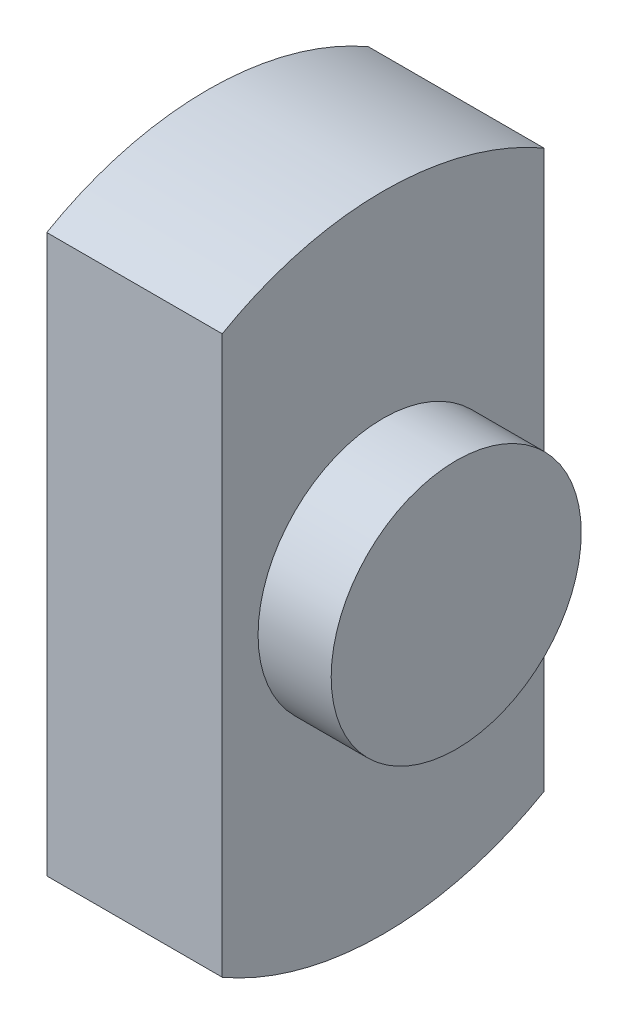
ISO-10303-21;
HEADER;
FILE_DESCRIPTION(('STEP AP214'),'2;1');
FILE_NAME('part.step','',(''),(''),'','','');
FILE_SCHEMA(('AUTOMOTIVE_DESIGN { 1 0 10303 214 1 1 1 1 }'));
ENDSEC;
DATA;
#1=APPLICATION_CONTEXT('core data for automotive mechanical design processes');
#2=APPLICATION_PROTOCOL_DEFINITION('international standard','automotive_design',2000,#1);
#3=PRODUCT_CONTEXT('',#1,'mechanical');
#4=PRODUCT('Part','Part','',(#3));
#5=PRODUCT_RELATED_PRODUCT_CATEGORY('part','',(#4));
#6=PRODUCT_DEFINITION_FORMATION('','',#4);
#7=PRODUCT_DEFINITION_CONTEXT('part definition',#1,'design');
#8=PRODUCT_DEFINITION('design','',#6,#7);
#9=PRODUCT_DEFINITION_SHAPE('','',#8);
#10=(LENGTH_UNIT() NAMED_UNIT(*) SI_UNIT(.MILLI.,.METRE.));
#11=(NAMED_UNIT(*) PLANE_ANGLE_UNIT() SI_UNIT($,.RADIAN.));
#12=(NAMED_UNIT(*) SI_UNIT($,.STERADIAN.) SOLID_ANGLE_UNIT());
#13=UNCERTAINTY_MEASURE_WITH_UNIT(LENGTH_MEASURE(1.E-05),#10,'distance_accuracy_value','');
#14=(GEOMETRIC_REPRESENTATION_CONTEXT(3) GLOBAL_UNCERTAINTY_ASSIGNED_CONTEXT((#13)) GLOBAL_UNIT_ASSIGNED_CONTEXT((#10,
#11,#12)) REPRESENTATION_CONTEXT('',''));
#15=CARTESIAN_POINT('',(0.,0.,0.));
#16=DIRECTION('',(0.,0.,1.));
#17=DIRECTION('',(1.,0.,0.));
#18=AXIS2_PLACEMENT_3D('',#15,#16,#17);
#19=CARTESIAN_POINT('',(12.,0.,0.));
#20=DIRECTION('',(-1.,0.,0.));
#21=DIRECTION('',(0.,0.,1.));
#22=AXIS2_PLACEMENT_3D('',#19,#20,#21);
#23=CYLINDRICAL_SURFACE('',#22,22.);
#24=CARTESIAN_POINT('',(12.,0.,0.));
#25=DIRECTION('',(1.,0.,0.));
#26=DIRECTION('',(0.,0.,-1.));
#27=AXIS2_PLACEMENT_3D('',#24,#25,#26);
#28=CIRCLE('',#27,22.);
#29=CARTESIAN_POINT('',(12.,-19.0525588832576,11.));
#30=VERTEX_POINT('',#29);
#31=CARTESIAN_POINT('',(12.,-19.0525588832576,-11.));
#32=VERTEX_POINT('',#31);
#33=EDGE_CURVE('E257',#30,#32,#28,.T.);
#34=ORIENTED_EDGE('',*,*,#33,.F.);
#35=DIRECTION('',(-1.,0.,0.));
#36=VECTOR('',#35,1.);
#37=CARTESIAN_POINT('',(12.,-19.0525588832576,11.));
#38=LINE('',#37,#36);
#39=CARTESIAN_POINT('',(0.,-19.0525588832576,11.));
#40=VERTEX_POINT('',#39);
#41=EDGE_CURVE('E635',#30,#40,#38,.T.);
#42=ORIENTED_EDGE('',*,*,#41,.T.);
#43=CARTESIAN_POINT('',(0.,0.,0.));
#44=DIRECTION('',(1.,0.,0.));
#45=DIRECTION('',(0.,0.,-1.));
#46=AXIS2_PLACEMENT_3D('',#43,#44,#45);
#47=CIRCLE('',#46,22.);
#48=CARTESIAN_POINT('',(0.,-21.837327130716,2.67042015160434));
#49=VERTEX_POINT('',#48);
#50=EDGE_CURVE('E253',#40,#49,#47,.T.);
#51=ORIENTED_EDGE('',*,*,#50,.T.);
#52=DIRECTION('',(-1.,0.,0.));
#53=VECTOR('',#52,1.);
#54=CARTESIAN_POINT('',(5.5,-21.837327130716,2.67042015160434));
#55=LINE('',#54,#53);
#56=CARTESIAN_POINT('',(5.5,-21.837327130716,2.67042015160434));
#57=VERTEX_POINT('',#56);
#58=EDGE_CURVE('E470',#57,#49,#55,.T.);
#59=ORIENTED_EDGE('',*,*,#58,.F.);
#60=CARTESIAN_POINT('',(5.5,0.,0.));
#61=DIRECTION('',(1.,0.,0.));
#62=DIRECTION('',(0.,0.,-1.));
#63=AXIS2_PLACEMENT_3D('',#60,#61,#62);
#64=CIRCLE('',#63,22.);
#65=CARTESIAN_POINT('',(5.5,-21.837327130716,-2.67042015160433));
#66=VERTEX_POINT('',#65);
#67=EDGE_CURVE('E262',#57,#66,#64,.T.);
#68=ORIENTED_EDGE('',*,*,#67,.T.);
#69=DIRECTION('',(-1.,0.,0.));
#70=VECTOR('',#69,1.);
#71=CARTESIAN_POINT('',(5.5,-21.837327130716,-2.67042015160433));
#72=LINE('',#71,#70);
#73=CARTESIAN_POINT('',(0.,-21.837327130716,-2.67042015160433));
#74=VERTEX_POINT('',#73);
#75=EDGE_CURVE('E474',#66,#74,#72,.T.);
#76=ORIENTED_EDGE('',*,*,#75,.T.);
#77=CARTESIAN_POINT('',(0.,-19.0525588832576,-11.));
#78=VERTEX_POINT('',#77);
#79=EDGE_CURVE('E252',#74,#78,#47,.T.);
#80=ORIENTED_EDGE('',*,*,#79,.T.);
#81=DIRECTION('',(-1.,0.,0.));
#82=VECTOR('',#81,1.);
#83=CARTESIAN_POINT('',(12.,-19.0525588832576,-11.));
#84=LINE('',#83,#82);
#85=EDGE_CURVE('E62',#78,#32,#84,.F.);
#86=ORIENTED_EDGE('',*,*,#85,.T.);
#87=EDGE_LOOP('',(#34,#42,#51,#59,#68,#76,#80,#86));
#88=FACE_BOUND('',#87,.T.);
#89=ADVANCED_FACE('F39',(#88),#23,.T.);
#90=CARTESIAN_POINT('',(5.5,19.5568517413347,6.50000000000001));
#91=DIRECTION('',(0.,0.,-1.));
#92=DIRECTION('',(0.,1.,0.));
#93=AXIS2_PLACEMENT_3D('',#90,#91,#92);
#94=PLANE('',#93);
#95=DIRECTION('',(-1.,0.,0.));
#96=VECTOR('',#95,1.);
#97=CARTESIAN_POINT('',(5.5,-6.94314825866529,6.5));
#98=LINE('',#97,#96);
#99=CARTESIAN_POINT('',(5.5,-6.94314825866529,6.5));
#100=VERTEX_POINT('',#99);
#101=CARTESIAN_POINT('',(4.25,-6.94314825866529,6.5));
#102=VERTEX_POINT('',#101);
#103=EDGE_CURVE('E457',#100,#102,#98,.T.);
#104=ORIENTED_EDGE('',*,*,#103,.T.);
#105=DIRECTION('',(0.,-1.,0.));
#106=VECTOR('',#105,1.);
#107=CARTESIAN_POINT('',(4.25,-5.94314825866529,6.5));
#108=LINE('',#107,#106);
#109=CARTESIAN_POINT('',(4.25,-5.94314825866529,6.5));
#110=VERTEX_POINT('',#109);
#111=EDGE_CURVE('E651',#110,#102,#108,.T.);
#112=ORIENTED_EDGE('',*,*,#111,.F.);
#113=DIRECTION('',(1.,0.,0.));
#114=VECTOR('',#113,1.);
#115=CARTESIAN_POINT('',(0.,-5.94314825866529,6.5));
#116=LINE('',#115,#114);
#117=CARTESIAN_POINT('',(3.,-5.94314825866529,6.5));
#118=VERTEX_POINT('',#117);
#119=EDGE_CURVE('E511',#118,#110,#116,.T.);
#120=ORIENTED_EDGE('',*,*,#119,.F.);
#121=DIRECTION('',(0.,1.,0.));
#122=VECTOR('',#121,1.);
#123=CARTESIAN_POINT('',(3.,19.5568517413347,6.50000000000001));
#124=LINE('',#123,#122);
#125=CARTESIAN_POINT('',(3.,17.1748906632346,6.50000000000001));
#126=VERTEX_POINT('',#125);
#127=EDGE_CURVE('E355',#118,#126,#124,.T.);
#128=ORIENTED_EDGE('',*,*,#127,.T.);
#129=DIRECTION('',(1.,0.,0.));
#130=VECTOR('',#129,1.);
#131=CARTESIAN_POINT('',(5.5,17.1748906632346,6.50000000000001));
#132=LINE('',#131,#130);
#133=CARTESIAN_POINT('',(0.,17.1748906632346,6.5));
#134=VERTEX_POINT('',#133);
#135=EDGE_CURVE('E370',#134,#126,#132,.T.);
#136=ORIENTED_EDGE('',*,*,#135,.F.);
#137=DIRECTION('',(0.,-1.,0.));
#138=VECTOR('',#137,1.);
#139=CARTESIAN_POINT('',(0.,19.5568517413347,6.50000000000001));
#140=LINE('',#139,#138);
#141=CARTESIAN_POINT('',(0.,19.5568517413347,6.50000000000001));
#142=VERTEX_POINT('',#141);
#143=EDGE_CURVE('E380',#142,#134,#140,.T.);
#144=ORIENTED_EDGE('',*,*,#143,.F.);
#145=DIRECTION('',(-1.,0.,0.));
#146=VECTOR('',#145,1.);
#147=CARTESIAN_POINT('',(5.5,19.5568517413347,6.50000000000001));
#148=LINE('',#147,#146);
#149=CARTESIAN_POINT('',(5.5,19.5568517413347,6.50000000000001));
#150=VERTEX_POINT('',#149);
#151=EDGE_CURVE('E258',#150,#142,#148,.T.);
#152=ORIENTED_EDGE('',*,*,#151,.F.);
#153=DIRECTION('',(0.,-1.,0.));
#154=VECTOR('',#153,1.);
#155=CARTESIAN_POINT('',(5.5,19.5568517413347,6.50000000000001));
#156=LINE('',#155,#154);
#157=EDGE_CURVE('E413',#150,#100,#156,.T.);
#158=ORIENTED_EDGE('',*,*,#157,.T.);
#159=EDGE_LOOP('',(#104,#112,#120,#128,#136,#144,#152,#158));
#160=FACE_BOUND('',#159,.T.);
#161=ADVANCED_FACE('F508',(#160),#94,.T.);
#162=CARTESIAN_POINT('',(5.5,-6.94314825866529,6.5));
#163=DIRECTION('',(0.,1.,0.));
#164=DIRECTION('',(0.,0.,1.));
#165=AXIS2_PLACEMENT_3D('',#162,#163,#164);
#166=PLANE('',#165);
#167=DIRECTION('',(0.,0.,1.));
#168=VECTOR('',#167,1.);
#169=CARTESIAN_POINT('',(3.,-6.9431482586653,9.00000000000001));
#170=LINE('',#169,#168);
#171=CARTESIAN_POINT('',(3.,-6.9431482586653,6.5));
#172=VERTEX_POINT('',#171);
#173=CARTESIAN_POINT('',(3.,-6.9431482586653,9.00000000000001));
#174=VERTEX_POINT('',#173);
#175=EDGE_CURVE('E325',#172,#174,#170,.T.);
#176=ORIENTED_EDGE('',*,*,#175,.F.);
#177=DIRECTION('',(1.,0.,0.));
#178=VECTOR('',#177,1.);
#179=CARTESIAN_POINT('',(0.,-6.94314825866529,6.5));
#180=LINE('',#179,#178);
#181=CARTESIAN_POINT('',(0.,-6.94314825866529,6.5));
#182=VERTEX_POINT('',#181);
#183=EDGE_CURVE('E654',#182,#172,#180,.T.);
#184=ORIENTED_EDGE('',*,*,#183,.F.);
#185=DIRECTION('',(0.,0.,-1.));
#186=VECTOR('',#185,1.);
#187=CARTESIAN_POINT('',(0.,-6.94314825866529,6.5));
#188=LINE('',#187,#186);
#189=CARTESIAN_POINT('',(0.,-6.9431482586653,9.00000000000001));
#190=VERTEX_POINT('',#189);
#191=EDGE_CURVE('E448',#190,#182,#188,.T.);
#192=ORIENTED_EDGE('',*,*,#191,.F.);
#193=DIRECTION('',(-1.,0.,0.));
#194=VECTOR('',#193,1.);
#195=CARTESIAN_POINT('',(3.,-6.9431482586653,9.00000000000001));
#196=LINE('',#195,#194);
#197=EDGE_CURVE('E359',#174,#190,#196,.T.);
#198=ORIENTED_EDGE('',*,*,#197,.F.);
#199=EDGE_LOOP('',(#176,#184,#192,#198));
#200=FACE_BOUND('',#199,.T.);
#201=ADVANCED_FACE('F546',(#200),#166,.T.);
#202=DIRECTION('',(-1.,0.,0.));
#203=VECTOR('',#202,1.);
#204=CARTESIAN_POINT('',(5.5,-6.94314825866529,4.76239289224447));
#205=LINE('',#204,#203);
#206=CARTESIAN_POINT('',(5.5,-6.94314825866529,4.76239289224447));
#207=VERTEX_POINT('',#206);
#208=CARTESIAN_POINT('',(4.25,-6.94314825866529,4.76239289224447));
#209=VERTEX_POINT('',#208);
#210=EDGE_CURVE('E461',#207,#209,#205,.T.);
#211=ORIENTED_EDGE('',*,*,#210,.T.);
#212=DIRECTION('',(0.,0.,-1.));
#213=VECTOR('',#212,1.);
#214=CARTESIAN_POINT('',(4.25,-6.94314825866529,4.76239289224447));
#215=LINE('',#214,#213);
#216=EDGE_CURVE('E646',#102,#209,#215,.T.);
#217=ORIENTED_EDGE('',*,*,#216,.F.);
#218=ORIENTED_EDGE('',*,*,#103,.F.);
#219=DIRECTION('',(0.,0.,-1.));
#220=VECTOR('',#219,1.);
#221=CARTESIAN_POINT('',(5.5,-6.94314825866529,6.5));
#222=LINE('',#221,#220);
#223=EDGE_CURVE('E410',#100,#207,#222,.T.);
#224=ORIENTED_EDGE('',*,*,#223,.T.);
#225=EDGE_LOOP('',(#211,#217,#218,#224));
#226=FACE_BOUND('',#225,.T.);
#227=ADVANCED_FACE('F585',(#226),#166,.T.);
#228=CARTESIAN_POINT('',(5.5,-6.94314825866529,-6.5));
#229=DIRECTION('',(0.,-1.,0.));
#230=DIRECTION('',(0.,0.,-1.));
#231=AXIS2_PLACEMENT_3D('',#228,#229,#230);
#232=PLANE('',#231);
#233=DIRECTION('',(0.,0.,-1.));
#234=VECTOR('',#233,1.);
#235=CARTESIAN_POINT('',(4.,-6.94314825866529,-6.51239289224447));
#236=LINE('',#235,#234);
#237=CARTESIAN_POINT('',(4.,-6.94314825866529,-4.76239289224447));
#238=VERTEX_POINT('',#237);
#239=CARTESIAN_POINT('',(4.,-6.94314825866529,-6.5));
#240=VERTEX_POINT('',#239);
#241=EDGE_CURVE('E289',#238,#240,#236,.T.);
#242=ORIENTED_EDGE('',*,*,#241,.F.);
#243=DIRECTION('',(-1.,0.,0.));
#244=VECTOR('',#243,1.);
#245=CARTESIAN_POINT('',(5.5,-6.94314825866529,-4.76239289224447));
#246=LINE('',#245,#244);
#247=CARTESIAN_POINT('',(5.5,-6.94314825866529,-4.76239289224447));
#248=VERTEX_POINT('',#247);
#249=EDGE_CURVE('E484',#248,#238,#246,.T.);
#250=ORIENTED_EDGE('',*,*,#249,.F.);
#251=DIRECTION('',(0.,0.,1.));
#252=VECTOR('',#251,1.);
#253=CARTESIAN_POINT('',(5.5,-6.94314825866529,-6.5));
#254=LINE('',#253,#252);
#255=CARTESIAN_POINT('',(5.5,-6.94314825866529,-6.5));
#256=VERTEX_POINT('',#255);
#257=EDGE_CURVE('E384',#256,#248,#254,.T.);
#258=ORIENTED_EDGE('',*,*,#257,.F.);
#259=DIRECTION('',(-1.,0.,0.));
#260=VECTOR('',#259,1.);
#261=CARTESIAN_POINT('',(5.5,-6.94314825866529,-6.5));
#262=LINE('',#261,#260);
#263=EDGE_CURVE('E488',#256,#240,#262,.T.);
#264=ORIENTED_EDGE('',*,*,#263,.T.);
#265=EDGE_LOOP('',(#242,#250,#258,#264));
#266=FACE_BOUND('',#265,.T.);
#267=ADVANCED_FACE('F607',(#266),#232,.F.);
#268=DIRECTION('',(-1.,0.,0.));
#269=VECTOR('',#268,1.);
#270=CARTESIAN_POINT('',(0.,-6.94314825866529,-6.51239289224447));
#271=LINE('',#270,#269);
#272=CARTESIAN_POINT('',(3.,-6.94314825866529,-6.51239289224447));
#273=VERTEX_POINT('',#272);
#274=CARTESIAN_POINT('',(0.,-6.94314825866529,-6.51239289224447));
#275=VERTEX_POINT('',#274);
#276=EDGE_CURVE('E619',#273,#275,#271,.T.);
#277=ORIENTED_EDGE('',*,*,#276,.F.);
#278=CARTESIAN_POINT('',(3.,-6.9431482586653,-9.));
#279=VERTEX_POINT('',#278);
#280=EDGE_CURVE('E327',#279,#273,#170,.T.);
#281=ORIENTED_EDGE('',*,*,#280,.F.);
#282=DIRECTION('',(-1.,0.,0.));
#283=VECTOR('',#282,1.);
#284=CARTESIAN_POINT('',(3.,-6.9431482586653,-9.));
#285=LINE('',#284,#283);
#286=CARTESIAN_POINT('',(0.,-6.9431482586653,-9.));
#287=VERTEX_POINT('',#286);
#288=EDGE_CURVE('E340',#279,#287,#285,.T.);
#289=ORIENTED_EDGE('',*,*,#288,.T.);
#290=DIRECTION('',(0.,0.,1.));
#291=VECTOR('',#290,1.);
#292=CARTESIAN_POINT('',(0.,-6.94314825866529,-6.5));
#293=LINE('',#292,#291);
#294=EDGE_CURVE('E423',#287,#275,#293,.T.);
#295=ORIENTED_EDGE('',*,*,#294,.T.);
#296=EDGE_LOOP('',(#277,#281,#289,#295));
#297=FACE_BOUND('',#296,.T.);
#298=ADVANCED_FACE('F561',(#297),#232,.F.);
#299=CARTESIAN_POINT('',(5.5,19.5568517413347,-6.49999999999999));
#300=DIRECTION('',(0.,0.,-1.));
#301=DIRECTION('',(0.,1.,0.));
#302=AXIS2_PLACEMENT_3D('',#299,#300,#301);
#303=PLANE('',#302);
#304=DIRECTION('',(0.,1.,0.));
#305=VECTOR('',#304,1.);
#306=CARTESIAN_POINT('',(4.,19.5568517413347,-6.49999999999999));
#307=LINE('',#306,#305);
#308=CARTESIAN_POINT('',(4.,-5.94314825866529,-6.5));
#309=VERTEX_POINT('',#308);
#310=EDGE_CURVE('E239',#240,#309,#307,.T.);
#311=ORIENTED_EDGE('',*,*,#310,.F.);
#312=ORIENTED_EDGE('',*,*,#263,.F.);
#313=DIRECTION('',(0.,-1.,0.));
#314=VECTOR('',#313,1.);
#315=CARTESIAN_POINT('',(5.5,19.5568517413347,-6.49999999999999));
#316=LINE('',#315,#314);
#317=CARTESIAN_POINT('',(5.5,19.5568517413347,-6.49999999999999));
#318=VERTEX_POINT('',#317);
#319=EDGE_CURVE('E379',#318,#256,#316,.T.);
#320=ORIENTED_EDGE('',*,*,#319,.F.);
#321=DIRECTION('',(-1.,0.,0.));
#322=VECTOR('',#321,1.);
#323=CARTESIAN_POINT('',(5.5,19.5568517413347,-6.49999999999999));
#324=LINE('',#323,#322);
#325=CARTESIAN_POINT('',(0.,19.5568517413347,-6.49999999999999));
#326=VERTEX_POINT('',#325);
#327=EDGE_CURVE('E416',#318,#326,#324,.T.);
#328=ORIENTED_EDGE('',*,*,#327,.T.);
#329=DIRECTION('',(0.,-1.,0.));
#330=VECTOR('',#329,1.);
#331=CARTESIAN_POINT('',(0.,19.5568517413347,-6.49999999999999));
#332=LINE('',#331,#330);
#333=CARTESIAN_POINT('',(0.,17.1748906632345,-6.5));
#334=VERTEX_POINT('',#333);
#335=EDGE_CURVE('E419',#326,#334,#332,.T.);
#336=ORIENTED_EDGE('',*,*,#335,.T.);
#337=DIRECTION('',(1.,0.,0.));
#338=VECTOR('',#337,1.);
#339=CARTESIAN_POINT('',(5.5,17.1748906632345,-6.49999999999999));
#340=LINE('',#339,#338);
#341=CARTESIAN_POINT('',(3.,17.1748906632345,-6.5));
#342=VERTEX_POINT('',#341);
#343=EDGE_CURVE('E268',#334,#342,#340,.T.);
#344=ORIENTED_EDGE('',*,*,#343,.T.);
#345=DIRECTION('',(0.,1.,0.));
#346=VECTOR('',#345,1.);
#347=CARTESIAN_POINT('',(3.,19.5568517413347,-6.49999999999999));
#348=LINE('',#347,#346);
#349=CARTESIAN_POINT('',(3.,-5.94314825866529,-6.5));
#350=VERTEX_POINT('',#349);
#351=EDGE_CURVE('E265',#350,#342,#348,.T.);
#352=ORIENTED_EDGE('',*,*,#351,.F.);
#353=DIRECTION('',(-1.,0.,0.));
#354=VECTOR('',#353,1.);
#355=CARTESIAN_POINT('',(5.5,-5.94314825866529,-6.5));
#356=LINE('',#355,#354);
#357=EDGE_CURVE('E295',#309,#350,#356,.T.);
#358=ORIENTED_EDGE('',*,*,#357,.F.);
#359=EDGE_LOOP('',(#311,#312,#320,#328,#336,#344,#352,#358));
#360=FACE_BOUND('',#359,.T.);
#361=ADVANCED_FACE('F304',(#360),#303,.F.);
#362=CARTESIAN_POINT('',(3.,0.,0.));
#363=DIRECTION('',(-1.,0.,0.));
#364=DIRECTION('',(0.,0.,1.));
#365=AXIS2_PLACEMENT_3D('',#362,#363,#364);
#366=PLANE('',#365);
#367=ORIENTED_EDGE('',*,*,#280,.T.);
#368=DIRECTION('',(0.,1.,0.));
#369=VECTOR('',#368,1.);
#370=CARTESIAN_POINT('',(3.,0.,-6.51239289224447));
#371=LINE('',#370,#369);
#372=CARTESIAN_POINT('',(3.,-5.94314825866529,-6.51239289224447));
#373=VERTEX_POINT('',#372);
#374=EDGE_CURVE('E277',#273,#373,#371,.T.);
#375=ORIENTED_EDGE('',*,*,#374,.T.);
#376=DIRECTION('',(0.,0.,1.));
#377=VECTOR('',#376,1.);
#378=CARTESIAN_POINT('',(3.,-5.94314825866529,0.));
#379=LINE('',#378,#377);
#380=EDGE_CURVE('E273',#373,#350,#379,.T.);
#381=ORIENTED_EDGE('',*,*,#380,.T.);
#382=ORIENTED_EDGE('',*,*,#351,.T.);
#383=DIRECTION('',(0.,0.,-1.));
#384=VECTOR('',#383,1.);
#385=CARTESIAN_POINT('',(3.,17.1748906632346,9.));
#386=LINE('',#385,#384);
#387=CARTESIAN_POINT('',(3.,17.1748906632345,-9.00000000000001));
#388=VERTEX_POINT('',#387);
#389=EDGE_CURVE('E335',#342,#388,#386,.T.);
#390=ORIENTED_EDGE('',*,*,#389,.T.);
#391=DIRECTION('',(0.,-1.,0.));
#392=VECTOR('',#391,1.);
#393=CARTESIAN_POINT('',(3.,-6.9431482586653,-9.));
#394=LINE('',#393,#392);
#395=EDGE_CURVE('E321',#388,#279,#394,.T.);
#396=ORIENTED_EDGE('',*,*,#395,.T.);
#397=EDGE_LOOP('',(#367,#375,#381,#382,#390,#396));
#398=FACE_BOUND('',#397,.T.);
#399=ADVANCED_FACE('F550',(#398),#366,.T.);
#400=CARTESIAN_POINT('',(0.,19.0525588832576,-11.));
#401=VERTEX_POINT('',#400);
#402=CARTESIAN_POINT('',(0.,19.0525588832576,11.));
#403=VERTEX_POINT('',#402);
#404=EDGE_CURVE('E243',#401,#403,#47,.T.);
#405=ORIENTED_EDGE('',*,*,#404,.T.);
#406=DIRECTION('',(-1.,0.,0.));
#407=VECTOR('',#406,1.);
#408=CARTESIAN_POINT('',(12.,19.0525588832576,11.));
#409=LINE('',#408,#407);
#410=CARTESIAN_POINT('',(12.,19.0525588832576,11.));
#411=VERTEX_POINT('',#410);
#412=EDGE_CURVE('E55',#403,#411,#409,.F.);
#413=ORIENTED_EDGE('',*,*,#412,.T.);
#414=CARTESIAN_POINT('',(12.,19.0525588832576,-11.));
#415=VERTEX_POINT('',#414);
#416=EDGE_CURVE('E245',#415,#411,#28,.T.);
#417=ORIENTED_EDGE('',*,*,#416,.F.);
#418=DIRECTION('',(-1.,0.,0.));
#419=VECTOR('',#418,1.);
#420=CARTESIAN_POINT('',(12.,19.0525588832576,-11.));
#421=LINE('',#420,#419);
#422=EDGE_CURVE('E232',#415,#401,#421,.T.);
#423=ORIENTED_EDGE('',*,*,#422,.T.);
#424=EDGE_LOOP('',(#405,#413,#417,#423));
#425=FACE_BOUND('',#424,.T.);
#426=ADVANCED_FACE('F41',(#425),#23,.T.);
#427=CARTESIAN_POINT('',(12.,0.,0.));
#428=DIRECTION('',(1.,0.,0.));
#429=DIRECTION('',(0.,0.,-1.));
#430=AXIS2_PLACEMENT_3D('',#427,#428,#429);
#431=PLANE('',#430);
#432=DIRECTION('',(0.,1.,0.));
#433=VECTOR('',#432,1.);
#434=CARTESIAN_POINT('',(12.,0.,11.));
#435=LINE('',#434,#433);
#436=EDGE_CURVE('E247',#30,#411,#435,.T.);
#437=ORIENTED_EDGE('',*,*,#436,.F.);
#438=ORIENTED_EDGE('',*,*,#33,.T.);
#439=DIRECTION('',(0.,-1.,0.));
#440=VECTOR('',#439,1.);
#441=CARTESIAN_POINT('',(12.,0.,-11.));
#442=LINE('',#441,#440);
#443=EDGE_CURVE('E816',#415,#32,#442,.T.);
#444=ORIENTED_EDGE('',*,*,#443,.F.);
#445=ORIENTED_EDGE('',*,*,#416,.T.);
#446=EDGE_LOOP('',(#437,#438,#444,#445));
#447=FACE_BOUND('',#446,.T.);
#448=CARTESIAN_POINT('',(12.,0.,0.));
#449=DIRECTION('',(1.,0.,0.));
#450=DIRECTION('',(0.,0.,-1.));
#451=AXIS2_PLACEMENT_3D('',#448,#449,#450);
#452=CIRCLE('',#451,8.55);
#453=CARTESIAN_POINT('',(12.,0.,-8.55));
#454=VERTEX_POINT('',#453);
#455=EDGE_CURVE('E272',#454,#454,#452,.T.);
#456=ORIENTED_EDGE('',*,*,#455,.F.);
#457=EDGE_LOOP('',(#456));
#458=FACE_BOUND('',#457,.T.);
#459=ADVANCED_FACE('F549',(#447,#458),#431,.T.);
#460=CARTESIAN_POINT('',(0.,0.,0.));
#461=DIRECTION('',(1.,0.,0.));
#462=DIRECTION('',(0.,0.,-1.));
#463=AXIS2_PLACEMENT_3D('',#460,#461,#462);
#464=PLANE('',#463);
#465=ORIENTED_EDGE('',*,*,#50,.F.);
#466=DIRECTION('',(0.,1.,0.));
#467=VECTOR('',#466,1.);
#468=CARTESIAN_POINT('',(0.,0.,11.));
#469=LINE('',#468,#467);
#470=EDGE_CURVE('E12',#40,#403,#469,.T.);
#471=ORIENTED_EDGE('',*,*,#470,.T.);
#472=ORIENTED_EDGE('',*,*,#404,.F.);
#473=DIRECTION('',(0.,-1.,0.));
#474=VECTOR('',#473,1.);
#475=CARTESIAN_POINT('',(0.,0.,-11.));
#476=LINE('',#475,#474);
#477=EDGE_CURVE('E48',#401,#78,#476,.T.);
#478=ORIENTED_EDGE('',*,*,#477,.T.);
#479=ORIENTED_EDGE('',*,*,#79,.F.);
#480=DIRECTION('',(0.,-1.,0.));
#481=VECTOR('',#480,1.);
#482=CARTESIAN_POINT('',(0.,-16.8581606699215,-2.67042015160433));
#483=LINE('',#482,#481);
#484=CARTESIAN_POINT('',(0.,-16.5303712131336,-2.67042015160434));
#485=VERTEX_POINT('',#484);
#486=EDGE_CURVE('E434',#485,#74,#483,.T.);
#487=ORIENTED_EDGE('',*,*,#486,.F.);
#488=DIRECTION('',(0.,-0.95232868819424,0.305073875712488));
#489=VECTOR('',#488,1.);
#490=CARTESIAN_POINT('',(0.,-10.,-4.76239289224447));
#491=LINE('',#490,#489);
#492=CARTESIAN_POINT('',(0.,-10.,-4.76239289224447));
#493=VERTEX_POINT('',#492);
#494=EDGE_CURVE('E430',#493,#485,#491,.T.);
#495=ORIENTED_EDGE('',*,*,#494,.F.);
#496=DIRECTION('',(0.,1.,0.));
#497=VECTOR('',#496,1.);
#498=CARTESIAN_POINT('',(0.,-10.,-4.76239289224447));
#499=LINE('',#498,#497);
#500=CARTESIAN_POINT('',(0.,-5.94314825866529,-4.76239289224447));
#501=VERTEX_POINT('',#500);
#502=EDGE_CURVE('E427',#493,#501,#499,.T.);
#503=ORIENTED_EDGE('',*,*,#502,.T.);
#504=DIRECTION('',(0.,0.,1.));
#505=VECTOR('',#504,1.);
#506=CARTESIAN_POINT('',(0.,-5.94314825866529,-4.76239289224447));
#507=LINE('',#506,#505);
#508=CARTESIAN_POINT('',(0.,-5.94314825866529,-6.51239289224447));
#509=VERTEX_POINT('',#508);
#510=EDGE_CURVE('E676',#509,#501,#507,.T.);
#511=ORIENTED_EDGE('',*,*,#510,.F.);
#512=DIRECTION('',(0.,-1.,0.));
#513=VECTOR('',#512,1.);
#514=CARTESIAN_POINT('',(0.,-5.94314825866529,-6.51239289224447));
#515=LINE('',#514,#513);
#516=EDGE_CURVE('E314',#509,#275,#515,.T.);
#517=ORIENTED_EDGE('',*,*,#516,.T.);
#518=ORIENTED_EDGE('',*,*,#294,.F.);
#519=DIRECTION('',(0.,-1.,0.));
#520=VECTOR('',#519,1.);
#521=CARTESIAN_POINT('',(0.,-6.9431482586653,-9.));
#522=LINE('',#521,#520);
#523=CARTESIAN_POINT('',(0.,17.1748906632345,-9.00000000000001));
#524=VERTEX_POINT('',#523);
#525=EDGE_CURVE('E312',#524,#287,#522,.T.);
#526=ORIENTED_EDGE('',*,*,#525,.F.);
#527=DIRECTION('',(0.,0.,-1.));
#528=VECTOR('',#527,1.);
#529=CARTESIAN_POINT('',(0.,17.1748906632346,9.));
#530=LINE('',#529,#528);
#531=EDGE_CURVE('E348',#334,#524,#530,.T.);
#532=ORIENTED_EDGE('',*,*,#531,.F.);
#533=ORIENTED_EDGE('',*,*,#335,.F.);
#534=DIRECTION('',(0.,0.,-1.));
#535=VECTOR('',#534,1.);
#536=CARTESIAN_POINT('',(0.,19.5568517413347,6.50000000000001));
#537=LINE('',#536,#535);
#538=EDGE_CURVE('E374',#142,#326,#537,.T.);
#539=ORIENTED_EDGE('',*,*,#538,.F.);
#540=ORIENTED_EDGE('',*,*,#143,.T.);
#541=CARTESIAN_POINT('',(0.,17.1748906632346,9.));
#542=VERTEX_POINT('',#541);
#543=EDGE_CURVE('E326',#542,#134,#530,.T.);
#544=ORIENTED_EDGE('',*,*,#543,.F.);
#545=DIRECTION('',(0.,1.,0.));
#546=VECTOR('',#545,1.);
#547=CARTESIAN_POINT('',(0.,17.1748906632346,9.));
#548=LINE('',#547,#546);
#549=EDGE_CURVE('E344',#190,#542,#548,.T.);
#550=ORIENTED_EDGE('',*,*,#549,.F.);
#551=ORIENTED_EDGE('',*,*,#191,.T.);
#552=DIRECTION('',(0.,-1.,0.));
#553=VECTOR('',#552,1.);
#554=CARTESIAN_POINT('',(0.,-5.94314825866529,6.5));
#555=LINE('',#554,#553);
#556=CARTESIAN_POINT('',(0.,-5.94314825866529,6.5));
#557=VERTEX_POINT('',#556);
#558=EDGE_CURVE('E620',#557,#182,#555,.T.);
#559=ORIENTED_EDGE('',*,*,#558,.F.);
#560=DIRECTION('',(0.,0.,1.));
#561=VECTOR('',#560,1.);
#562=CARTESIAN_POINT('',(0.,-5.94314825866529,4.76239289224447));
#563=LINE('',#562,#561);
#564=CARTESIAN_POINT('',(0.,-5.94314825866529,4.76239289224447));
#565=VERTEX_POINT('',#564);
#566=EDGE_CURVE('E653',#565,#557,#563,.T.);
#567=ORIENTED_EDGE('',*,*,#566,.F.);
#568=DIRECTION('',(0.,1.,0.));
#569=VECTOR('',#568,1.);
#570=CARTESIAN_POINT('',(0.,-10.,4.76239289224447));
#571=LINE('',#570,#569);
#572=CARTESIAN_POINT('',(0.,-10.,4.76239289224447));
#573=VERTEX_POINT('',#572);
#574=EDGE_CURVE('E445',#573,#565,#571,.T.);
#575=ORIENTED_EDGE('',*,*,#574,.F.);
#576=DIRECTION('',(0.,-0.952328688194239,-0.305073875712489));
#577=VECTOR('',#576,1.);
#578=CARTESIAN_POINT('',(0.,-10.,4.76239289224447));
#579=LINE('',#578,#577);
#580=CARTESIAN_POINT('',(0.,-16.5303712131336,2.67042015160433));
#581=VERTEX_POINT('',#580);
#582=EDGE_CURVE('E441',#573,#581,#579,.T.);
#583=ORIENTED_EDGE('',*,*,#582,.T.);
#584=DIRECTION('',(0.,1.,0.));
#585=VECTOR('',#584,1.);
#586=CARTESIAN_POINT('',(0.,-16.8581606699215,2.67042015160433));
#587=LINE('',#586,#585);
#588=EDGE_CURVE('E437',#49,#581,#587,.T.);
#589=ORIENTED_EDGE('',*,*,#588,.F.);
#590=EDGE_LOOP('',(#465,#471,#472,#478,#479,#487,#495,#503,#511,#517,#518,#526,#532,#533,#539,
#540,#544,#550,#551,#559,#567,#575,#583,#589));
#591=FACE_BOUND('',#590,.T.);
#592=ADVANCED_FACE('F250',(#591),#464,.F.);
#593=CARTESIAN_POINT('',(5.5,0.,0.));
#594=DIRECTION('',(1.,0.,0.));
#595=DIRECTION('',(0.,0.,-1.));
#596=AXIS2_PLACEMENT_3D('',#593,#594,#595);
#597=PLANE('',#596);
#598=ORIENTED_EDGE('',*,*,#67,.F.);
#599=DIRECTION('',(0.,-1.,0.));
#600=VECTOR('',#599,1.);
#601=CARTESIAN_POINT('',(5.5,-16.8581606699215,2.67042015160433));
#602=LINE('',#601,#600);
#603=CARTESIAN_POINT('',(5.5,-16.5303712131336,2.67042015160433));
#604=VERTEX_POINT('',#603);
#605=EDGE_CURVE('E398',#604,#57,#602,.T.);
#606=ORIENTED_EDGE('',*,*,#605,.F.);
#607=DIRECTION('',(0.,-0.952328688194239,-0.305073875712489));
#608=VECTOR('',#607,1.);
#609=CARTESIAN_POINT('',(5.5,-10.,4.76239289224447));
#610=LINE('',#609,#608);
#611=CARTESIAN_POINT('',(5.5,-10.,4.76239289224447));
#612=VERTEX_POINT('',#611);
#613=EDGE_CURVE('E402',#612,#604,#610,.T.);
#614=ORIENTED_EDGE('',*,*,#613,.F.);
#615=DIRECTION('',(0.,1.,0.));
#616=VECTOR('',#615,1.);
#617=CARTESIAN_POINT('',(5.5,-10.,4.76239289224447));
#618=LINE('',#617,#616);
#619=EDGE_CURVE('E406',#612,#207,#618,.T.);
#620=ORIENTED_EDGE('',*,*,#619,.T.);
#621=ORIENTED_EDGE('',*,*,#223,.F.);
#622=ORIENTED_EDGE('',*,*,#157,.F.);
#623=DIRECTION('',(0.,0.,-1.));
#624=VECTOR('',#623,1.);
#625=CARTESIAN_POINT('',(5.5,19.5568517413347,6.50000000000001));
#626=LINE('',#625,#624);
#627=EDGE_CURVE('E375',#150,#318,#626,.T.);
#628=ORIENTED_EDGE('',*,*,#627,.T.);
#629=ORIENTED_EDGE('',*,*,#319,.T.);
#630=ORIENTED_EDGE('',*,*,#257,.T.);
#631=DIRECTION('',(0.,1.,0.));
#632=VECTOR('',#631,1.);
#633=CARTESIAN_POINT('',(5.5,-10.,-4.76239289224447));
#634=LINE('',#633,#632);
#635=CARTESIAN_POINT('',(5.5,-10.,-4.76239289224447));
#636=VERTEX_POINT('',#635);
#637=EDGE_CURVE('E388',#636,#248,#634,.T.);
#638=ORIENTED_EDGE('',*,*,#637,.F.);
#639=DIRECTION('',(0.,-0.95232868819424,0.305073875712488));
#640=VECTOR('',#639,1.);
#641=CARTESIAN_POINT('',(5.5,-10.,-4.76239289224447));
#642=LINE('',#641,#640);
#643=CARTESIAN_POINT('',(5.5,-16.5303712131336,-2.67042015160434));
#644=VERTEX_POINT('',#643);
#645=EDGE_CURVE('E391',#636,#644,#642,.T.);
#646=ORIENTED_EDGE('',*,*,#645,.T.);
#647=DIRECTION('',(0.,1.,0.));
#648=VECTOR('',#647,1.);
#649=CARTESIAN_POINT('',(5.5,-16.8581606699215,-2.67042015160433));
#650=LINE('',#649,#648);
#651=EDGE_CURVE('E395',#66,#644,#650,.T.);
#652=ORIENTED_EDGE('',*,*,#651,.F.);
#653=EDGE_LOOP('',(#598,#606,#614,#620,#621,#622,#628,#629,#630,#638,#646,#652));
#654=FACE_BOUND('',#653,.T.);
#655=ADVANCED_FACE('F524',(#654),#597,.F.);
#656=CARTESIAN_POINT('',(5.5,19.5568517413347,6.50000000000001));
#657=DIRECTION('',(0.,1.,0.));
#658=DIRECTION('',(0.,0.,1.));
#659=AXIS2_PLACEMENT_3D('',#656,#657,#658);
#660=PLANE('',#659);
#661=ORIENTED_EDGE('',*,*,#538,.T.);
#662=ORIENTED_EDGE('',*,*,#327,.F.);
#663=ORIENTED_EDGE('',*,*,#627,.F.);
#664=ORIENTED_EDGE('',*,*,#151,.T.);
#665=EDGE_LOOP('',(#661,#662,#663,#664));
#666=FACE_BOUND('',#665,.T.);
#667=ADVANCED_FACE('F525',(#666),#660,.F.);
#668=CARTESIAN_POINT('',(5.5,-10.,4.76239289224447));
#669=DIRECTION('',(0.,0.,1.));
#670=DIRECTION('',(1.,0.,0.));
#671=AXIS2_PLACEMENT_3D('',#668,#669,#670);
#672=PLANE('',#671);
#673=ORIENTED_EDGE('',*,*,#574,.T.);
#674=DIRECTION('',(-1.,0.,0.));
#675=VECTOR('',#674,1.);
#676=CARTESIAN_POINT('',(0.,-5.94314825866529,4.76239289224447));
#677=LINE('',#676,#675);
#678=CARTESIAN_POINT('',(4.25,-5.94314825866529,4.76239289224447));
#679=VERTEX_POINT('',#678);
#680=EDGE_CURVE('E666',#679,#565,#677,.T.);
#681=ORIENTED_EDGE('',*,*,#680,.F.);
#682=DIRECTION('',(0.,-1.,0.));
#683=VECTOR('',#682,1.);
#684=CARTESIAN_POINT('',(4.25,-5.94314825866529,4.76239289224447));
#685=LINE('',#684,#683);
#686=EDGE_CURVE('E644',#679,#209,#685,.T.);
#687=ORIENTED_EDGE('',*,*,#686,.T.);
#688=ORIENTED_EDGE('',*,*,#210,.F.);
#689=ORIENTED_EDGE('',*,*,#619,.F.);
#690=DIRECTION('',(-1.,0.,0.));
#691=VECTOR('',#690,1.);
#692=CARTESIAN_POINT('',(5.5,-10.,4.76239289224447));
#693=LINE('',#692,#691);
#694=EDGE_CURVE('E464',#612,#573,#693,.T.);
#695=ORIENTED_EDGE('',*,*,#694,.T.);
#696=EDGE_LOOP('',(#673,#681,#687,#688,#689,#695));
#697=FACE_BOUND('',#696,.T.);
#698=ADVANCED_FACE('F527',(#697),#672,.F.);
#699=CARTESIAN_POINT('',(5.5,-10.,4.76239289224447));
#700=DIRECTION('',(0.,0.305073875712489,-0.952328688194239));
#701=DIRECTION('',(0.,0.952328688194239,0.305073875712489));
#702=AXIS2_PLACEMENT_3D('',#699,#700,#701);
#703=PLANE('',#702);
#704=ORIENTED_EDGE('',*,*,#582,.F.);
#705=ORIENTED_EDGE('',*,*,#694,.F.);
#706=ORIENTED_EDGE('',*,*,#613,.T.);
#707=DIRECTION('',(-1.,0.,0.));
#708=VECTOR('',#707,1.);
#709=CARTESIAN_POINT('',(5.5,-16.5303712131336,2.67042015160433));
#710=LINE('',#709,#708);
#711=EDGE_CURVE('E467',#604,#581,#710,.T.);
#712=ORIENTED_EDGE('',*,*,#711,.T.);
#713=EDGE_LOOP('',(#704,#705,#706,#712));
#714=FACE_BOUND('',#713,.T.);
#715=ADVANCED_FACE('F533',(#714),#703,.T.);
#716=CARTESIAN_POINT('',(5.5,-16.8581606699215,2.67042015160433));
#717=DIRECTION('',(0.,0.,1.));
#718=DIRECTION('',(1.,0.,0.));
#719=AXIS2_PLACEMENT_3D('',#716,#717,#718);
#720=PLANE('',#719);
#721=ORIENTED_EDGE('',*,*,#588,.T.);
#722=ORIENTED_EDGE('',*,*,#711,.F.);
#723=ORIENTED_EDGE('',*,*,#605,.T.);
#724=ORIENTED_EDGE('',*,*,#58,.T.);
#725=EDGE_LOOP('',(#721,#722,#723,#724));
#726=FACE_BOUND('',#725,.T.);
#727=ADVANCED_FACE('F590',(#726),#720,.F.);
#728=CARTESIAN_POINT('',(5.5,-16.8581606699215,-2.67042015160433));
#729=DIRECTION('',(0.,0.,-1.));
#730=DIRECTION('',(-1.,0.,0.));
#731=AXIS2_PLACEMENT_3D('',#728,#729,#730);
#732=PLANE('',#731);
#733=ORIENTED_EDGE('',*,*,#486,.T.);
#734=ORIENTED_EDGE('',*,*,#75,.F.);
#735=ORIENTED_EDGE('',*,*,#651,.T.);
#736=DIRECTION('',(-1.,0.,0.));
#737=VECTOR('',#736,1.);
#738=CARTESIAN_POINT('',(5.5,-16.5303712131336,-2.67042015160434));
#739=LINE('',#738,#737);
#740=EDGE_CURVE('E478',#644,#485,#739,.T.);
#741=ORIENTED_EDGE('',*,*,#740,.T.);
#742=EDGE_LOOP('',(#733,#734,#735,#741));
#743=FACE_BOUND('',#742,.T.);
#744=ADVANCED_FACE('F594',(#743),#732,.F.);
#745=CARTESIAN_POINT('',(5.5,-10.,-4.76239289224447));
#746=DIRECTION('',(0.,-0.305073875712488,-0.95232868819424));
#747=DIRECTION('',(0.,0.95232868819424,-0.305073875712488));
#748=AXIS2_PLACEMENT_3D('',#745,#746,#747);
#749=PLANE('',#748);
#750=ORIENTED_EDGE('',*,*,#494,.T.);
#751=ORIENTED_EDGE('',*,*,#740,.F.);
#752=ORIENTED_EDGE('',*,*,#645,.F.);
#753=DIRECTION('',(-1.,0.,0.));
#754=VECTOR('',#753,1.);
#755=CARTESIAN_POINT('',(5.5,-10.,-4.76239289224447));
#756=LINE('',#755,#754);
#757=EDGE_CURVE('E481',#636,#493,#756,.T.);
#758=ORIENTED_EDGE('',*,*,#757,.T.);
#759=EDGE_LOOP('',(#750,#751,#752,#758));
#760=FACE_BOUND('',#759,.T.);
#761=ADVANCED_FACE('F598',(#760),#749,.F.);
#762=CARTESIAN_POINT('',(5.5,-10.,-4.76239289224447));
#763=DIRECTION('',(0.,0.,1.));
#764=DIRECTION('',(1.,0.,0.));
#765=AXIS2_PLACEMENT_3D('',#762,#763,#764);
#766=PLANE('',#765);
#767=ORIENTED_EDGE('',*,*,#502,.F.);
#768=ORIENTED_EDGE('',*,*,#757,.F.);
#769=ORIENTED_EDGE('',*,*,#637,.T.);
#770=ORIENTED_EDGE('',*,*,#249,.T.);
#771=DIRECTION('',(0.,-1.,0.));
#772=VECTOR('',#771,1.);
#773=CARTESIAN_POINT('',(4.,-5.94314825866529,-4.76239289224447));
#774=LINE('',#773,#772);
#775=CARTESIAN_POINT('',(4.,-5.94314825866529,-4.76239289224447));
#776=VERTEX_POINT('',#775);
#777=EDGE_CURVE('E307',#776,#238,#774,.T.);
#778=ORIENTED_EDGE('',*,*,#777,.F.);
#779=DIRECTION('',(1.,0.,0.));
#780=VECTOR('',#779,1.);
#781=CARTESIAN_POINT('',(4.,-5.94314825866529,-4.76239289224447));
#782=LINE('',#781,#780);
#783=EDGE_CURVE('E298',#501,#776,#782,.T.);
#784=ORIENTED_EDGE('',*,*,#783,.F.);
#785=EDGE_LOOP('',(#767,#768,#769,#770,#778,#784));
#786=FACE_BOUND('',#785,.T.);
#787=ADVANCED_FACE('F602',(#786),#766,.T.);
#788=CARTESIAN_POINT('',(3.,17.1748906632346,9.));
#789=DIRECTION('',(0.,1.,0.));
#790=DIRECTION('',(0.,0.,1.));
#791=AXIS2_PLACEMENT_3D('',#788,#789,#790);
#792=PLANE('',#791);
#793=ORIENTED_EDGE('',*,*,#531,.T.);
#794=DIRECTION('',(-1.,0.,0.));
#795=VECTOR('',#794,1.);
#796=CARTESIAN_POINT('',(3.,17.1748906632345,-9.00000000000001));
#797=LINE('',#796,#795);
#798=EDGE_CURVE('E351',#388,#524,#797,.T.);
#799=ORIENTED_EDGE('',*,*,#798,.F.);
#800=ORIENTED_EDGE('',*,*,#389,.F.);
#801=ORIENTED_EDGE('',*,*,#343,.F.);
#802=EDGE_LOOP('',(#793,#799,#800,#801));
#803=FACE_BOUND('',#802,.T.);
#804=ADVANCED_FACE('F579',(#803),#792,.F.);
#805=CARTESIAN_POINT('',(3.,-6.9431482586653,-9.));
#806=DIRECTION('',(0.,0.,-1.));
#807=DIRECTION('',(0.,1.,0.));
#808=AXIS2_PLACEMENT_3D('',#805,#806,#807);
#809=PLANE('',#808);
#810=ORIENTED_EDGE('',*,*,#525,.T.);
#811=ORIENTED_EDGE('',*,*,#288,.F.);
#812=ORIENTED_EDGE('',*,*,#395,.F.);
#813=ORIENTED_EDGE('',*,*,#798,.T.);
#814=EDGE_LOOP('',(#810,#811,#812,#813));
#815=FACE_BOUND('',#814,.T.);
#816=ADVANCED_FACE('F578',(#815),#809,.F.);
#817=ORIENTED_EDGE('',*,*,#135,.T.);
#818=CARTESIAN_POINT('',(3.,17.1748906632346,9.));
#819=VERTEX_POINT('',#818);
#820=EDGE_CURVE('E336',#819,#126,#386,.T.);
#821=ORIENTED_EDGE('',*,*,#820,.F.);
#822=DIRECTION('',(-1.,0.,0.));
#823=VECTOR('',#822,1.);
#824=CARTESIAN_POINT('',(3.,17.1748906632346,9.));
#825=LINE('',#824,#823);
#826=EDGE_CURVE('E356',#819,#542,#825,.T.);
#827=ORIENTED_EDGE('',*,*,#826,.T.);
#828=ORIENTED_EDGE('',*,*,#543,.T.);
#829=EDGE_LOOP('',(#817,#821,#827,#828));
#830=FACE_BOUND('',#829,.T.);
#831=ADVANCED_FACE('F517',(#830),#792,.F.);
#832=CARTESIAN_POINT('',(3.,17.1748906632346,9.));
#833=DIRECTION('',(0.,0.,1.));
#834=DIRECTION('',(0.,-1.,0.));
#835=AXIS2_PLACEMENT_3D('',#832,#833,#834);
#836=PLANE('',#835);
#837=ORIENTED_EDGE('',*,*,#549,.T.);
#838=ORIENTED_EDGE('',*,*,#826,.F.);
#839=DIRECTION('',(0.,1.,0.));
#840=VECTOR('',#839,1.);
#841=CARTESIAN_POINT('',(3.,17.1748906632346,9.));
#842=LINE('',#841,#840);
#843=EDGE_CURVE('E331',#174,#819,#842,.T.);
#844=ORIENTED_EDGE('',*,*,#843,.F.);
#845=ORIENTED_EDGE('',*,*,#197,.T.);
#846=EDGE_LOOP('',(#837,#838,#844,#845));
#847=FACE_BOUND('',#846,.T.);
#848=ADVANCED_FACE('F566',(#847),#836,.F.);
#849=ORIENTED_EDGE('',*,*,#175,.T.);
#850=ORIENTED_EDGE('',*,*,#843,.T.);
#851=ORIENTED_EDGE('',*,*,#820,.T.);
#852=ORIENTED_EDGE('',*,*,#127,.F.);
#853=EDGE_CURVE('E366',#172,#118,#124,.T.);
#854=ORIENTED_EDGE('',*,*,#853,.F.);
#855=EDGE_LOOP('',(#849,#850,#851,#852,#854));
#856=FACE_BOUND('',#855,.T.);
#857=ADVANCED_FACE('F514',(#856),#366,.T.);
#858=CARTESIAN_POINT('',(17.,0.,0.));
#859=DIRECTION('',(-1.,0.,0.));
#860=DIRECTION('',(0.,0.,1.));
#861=AXIS2_PLACEMENT_3D('',#858,#859,#860);
#862=CYLINDRICAL_SURFACE('',#861,8.55);
#863=CARTESIAN_POINT('',(17.,0.,0.));
#864=DIRECTION('',(1.,0.,0.));
#865=DIRECTION('',(0.,0.,-1.));
#866=AXIS2_PLACEMENT_3D('',#863,#864,#865);
#867=CIRCLE('',#866,8.55);
#868=CARTESIAN_POINT('',(17.,0.,-8.55));
#869=VERTEX_POINT('',#868);
#870=EDGE_CURVE('E306',#869,#869,#867,.T.);
#871=ORIENTED_EDGE('',*,*,#870,.F.);
#872=EDGE_LOOP('',(#871));
#873=FACE_BOUND('',#872,.T.);
#874=ORIENTED_EDGE('',*,*,#455,.T.);
#875=EDGE_LOOP('',(#874));
#876=FACE_BOUND('',#875,.T.);
#877=ADVANCED_FACE('F565',(#873,#876),#862,.T.);
#878=CARTESIAN_POINT('',(17.,0.,0.));
#879=DIRECTION('',(1.,0.,0.));
#880=DIRECTION('',(0.,0.,-1.));
#881=AXIS2_PLACEMENT_3D('',#878,#879,#880);
#882=PLANE('',#881);
#883=ORIENTED_EDGE('',*,*,#870,.T.);
#884=EDGE_LOOP('',(#883));
#885=FACE_BOUND('',#884,.T.);
#886=ADVANCED_FACE('F571',(#885),#882,.T.);
#887=CARTESIAN_POINT('',(4.,-5.94314825866529,-6.51239289224447));
#888=DIRECTION('',(-1.,0.,0.));
#889=DIRECTION('',(0.,0.,1.));
#890=AXIS2_PLACEMENT_3D('',#887,#888,#889);
#891=PLANE('',#890);
#892=ORIENTED_EDGE('',*,*,#241,.T.);
#893=ORIENTED_EDGE('',*,*,#310,.T.);
#894=DIRECTION('',(0.,0.,-1.));
#895=VECTOR('',#894,1.);
#896=CARTESIAN_POINT('',(4.,-5.94314825866529,-6.51239289224447));
#897=LINE('',#896,#895);
#898=EDGE_CURVE('E286',#776,#309,#897,.T.);
#899=ORIENTED_EDGE('',*,*,#898,.F.);
#900=ORIENTED_EDGE('',*,*,#777,.T.);
#901=EDGE_LOOP('',(#892,#893,#899,#900));
#902=FACE_BOUND('',#901,.T.);
#903=ADVANCED_FACE('F285',(#902),#891,.F.);
#904=CARTESIAN_POINT('',(0.,-5.94314825866529,0.));
#905=DIRECTION('',(0.,-1.,0.));
#906=DIRECTION('',(0.,0.,-1.));
#907=AXIS2_PLACEMENT_3D('',#904,#905,#906);
#908=PLANE('',#907);
#909=ORIENTED_EDGE('',*,*,#898,.T.);
#910=ORIENTED_EDGE('',*,*,#357,.T.);
#911=ORIENTED_EDGE('',*,*,#380,.F.);
#912=DIRECTION('',(-1.,0.,0.));
#913=VECTOR('',#912,1.);
#914=CARTESIAN_POINT('',(0.,-5.94314825866529,-6.51239289224447));
#915=LINE('',#914,#913);
#916=EDGE_CURVE('E301',#373,#509,#915,.T.);
#917=ORIENTED_EDGE('',*,*,#916,.T.);
#918=ORIENTED_EDGE('',*,*,#510,.T.);
#919=ORIENTED_EDGE('',*,*,#783,.T.);
#920=EDGE_LOOP('',(#909,#910,#911,#917,#918,#919));
#921=FACE_BOUND('',#920,.T.);
#922=ADVANCED_FACE('F294',(#921),#908,.F.);
#923=CARTESIAN_POINT('',(0.,-5.94314825866529,-6.51239289224447));
#924=DIRECTION('',(0.,0.,1.));
#925=DIRECTION('',(1.,0.,0.));
#926=AXIS2_PLACEMENT_3D('',#923,#924,#925);
#927=PLANE('',#926);
#928=ORIENTED_EDGE('',*,*,#374,.F.);
#929=ORIENTED_EDGE('',*,*,#276,.T.);
#930=ORIENTED_EDGE('',*,*,#516,.F.);
#931=ORIENTED_EDGE('',*,*,#916,.F.);
#932=EDGE_LOOP('',(#928,#929,#930,#931));
#933=FACE_BOUND('',#932,.T.);
#934=ADVANCED_FACE('F690',(#933),#927,.F.);
#935=CARTESIAN_POINT('',(0.,-5.94314825866529,6.5));
#936=DIRECTION('',(0.,0.,-1.));
#937=DIRECTION('',(0.,1.,0.));
#938=AXIS2_PLACEMENT_3D('',#935,#936,#937);
#939=PLANE('',#938);
#940=ORIENTED_EDGE('',*,*,#853,.T.);
#941=EDGE_CURVE('E826',#557,#118,#116,.T.);
#942=ORIENTED_EDGE('',*,*,#941,.F.);
#943=ORIENTED_EDGE('',*,*,#558,.T.);
#944=ORIENTED_EDGE('',*,*,#183,.T.);
#945=EDGE_LOOP('',(#940,#942,#943,#944));
#946=FACE_BOUND('',#945,.T.);
#947=ADVANCED_FACE('F692',(#946),#939,.F.);
#948=CARTESIAN_POINT('',(4.25,-5.94314825866529,4.76239289224447));
#949=DIRECTION('',(-1.,0.,0.));
#950=DIRECTION('',(0.,0.,1.));
#951=AXIS2_PLACEMENT_3D('',#948,#949,#950);
#952=PLANE('',#951);
#953=ORIENTED_EDGE('',*,*,#216,.T.);
#954=ORIENTED_EDGE('',*,*,#686,.F.);
#955=DIRECTION('',(0.,0.,-1.));
#956=VECTOR('',#955,1.);
#957=CARTESIAN_POINT('',(4.25,-5.94314825866529,4.76239289224447));
#958=LINE('',#957,#956);
#959=EDGE_CURVE('E830',#110,#679,#958,.T.);
#960=ORIENTED_EDGE('',*,*,#959,.F.);
#961=ORIENTED_EDGE('',*,*,#111,.T.);
#962=EDGE_LOOP('',(#953,#954,#960,#961));
#963=FACE_BOUND('',#962,.T.);
#964=ADVANCED_FACE('F649',(#963),#952,.F.);
#965=CARTESIAN_POINT('',(0.,-5.94314825866529,0.));
#966=DIRECTION('',(0.,1.,0.));
#967=DIRECTION('',(0.,0.,1.));
#968=AXIS2_PLACEMENT_3D('',#965,#966,#967);
#969=PLANE('',#968);
#970=ORIENTED_EDGE('',*,*,#566,.T.);
#971=ORIENTED_EDGE('',*,*,#941,.T.);
#972=ORIENTED_EDGE('',*,*,#119,.T.);
#973=ORIENTED_EDGE('',*,*,#959,.T.);
#974=ORIENTED_EDGE('',*,*,#680,.T.);
#975=EDGE_LOOP('',(#970,#971,#972,#973,#974));
#976=FACE_BOUND('',#975,.T.);
#977=ADVANCED_FACE('F775',(#976),#969,.T.);
#978=CARTESIAN_POINT('',(17.,28.937076387141,-11.));
#979=DIRECTION('',(0.,0.,1.));
#980=DIRECTION('',(0.,-1.,0.));
#981=AXIS2_PLACEMENT_3D('',#978,#979,#980);
#982=PLANE('',#981);
#983=ORIENTED_EDGE('',*,*,#443,.T.);
#984=ORIENTED_EDGE('',*,*,#85,.F.);
#985=ORIENTED_EDGE('',*,*,#477,.F.);
#986=ORIENTED_EDGE('',*,*,#422,.F.);
#987=EDGE_LOOP('',(#983,#984,#985,#986));
#988=FACE_BOUND('',#987,.T.);
#989=ADVANCED_FACE('F231',(#988),#982,.F.);
#990=CARTESIAN_POINT('',(17.,28.937076387141,11.));
#991=DIRECTION('',(0.,0.,-1.));
#992=DIRECTION('',(0.,1.,0.));
#993=AXIS2_PLACEMENT_3D('',#990,#991,#992);
#994=PLANE('',#993);
#995=ORIENTED_EDGE('',*,*,#436,.T.);
#996=ORIENTED_EDGE('',*,*,#412,.F.);
#997=ORIENTED_EDGE('',*,*,#470,.F.);
#998=ORIENTED_EDGE('',*,*,#41,.F.);
#999=EDGE_LOOP('',(#995,#996,#997,#998));
#1000=FACE_BOUND('',#999,.T.);
#1001=ADVANCED_FACE('F797',(#1000),#994,.F.);
#1002=CLOSED_SHELL('',(#89,#161,#201,#227,#267,#298,#361,#399,#426,#459,#592,#655,#667,#698,
#715,#727,#744,#761,#787,#804,#816,#831,#848,#857,#877,#886,#903,#922,#934,#947,#964,#977,#989,#1001));
#1003=MANIFOLD_SOLID_BREP('B2',#1002);
#1004=ADVANCED_BREP_SHAPE_REPRESENTATION('',(#18,#1003),#14);
#1005=SHAPE_DEFINITION_REPRESENTATION(#9,#1004);
ENDSEC;
END-ISO-10303-21;
